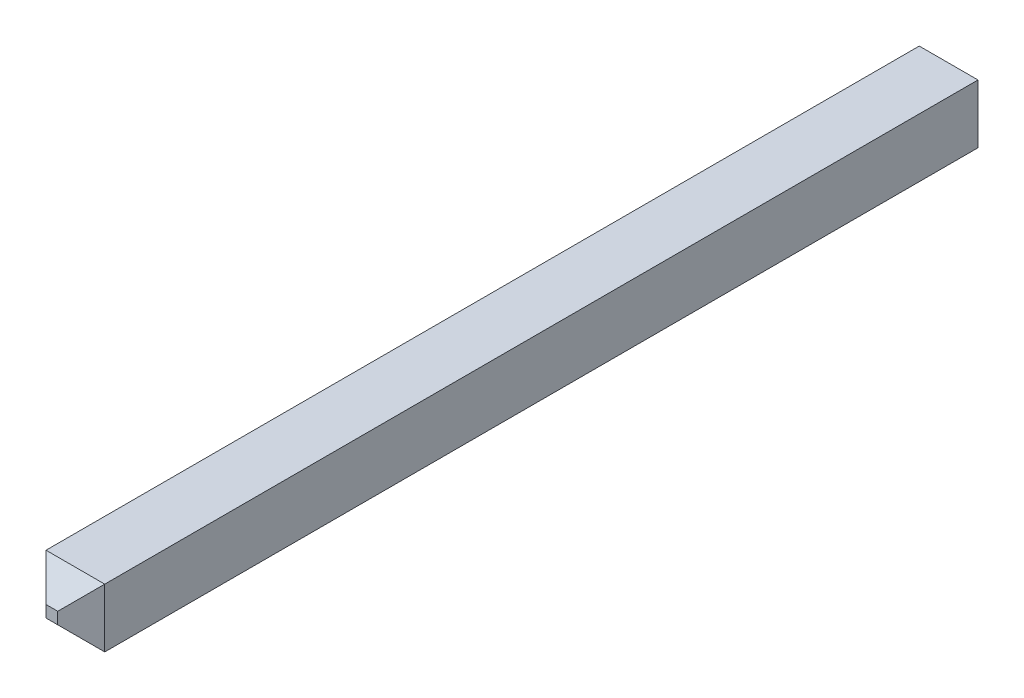
ISO-10303-21;
HEADER;
FILE_DESCRIPTION(('STEP AP214'),'2;1');
FILE_NAME('part.step','',(''),(''),'','','');
FILE_SCHEMA(('AUTOMOTIVE_DESIGN { 1 0 10303 214 1 1 1 1 }'));
ENDSEC;
DATA;
#1=APPLICATION_CONTEXT('core data for automotive mechanical design processes');
#2=APPLICATION_PROTOCOL_DEFINITION('international standard','automotive_design',2000,#1);
#3=PRODUCT_CONTEXT('',#1,'mechanical');
#4=PRODUCT('Part','Part','',(#3));
#5=PRODUCT_RELATED_PRODUCT_CATEGORY('part','',(#4));
#6=PRODUCT_DEFINITION_FORMATION('','',#4);
#7=PRODUCT_DEFINITION_CONTEXT('part definition',#1,'design');
#8=PRODUCT_DEFINITION('design','',#6,#7);
#9=PRODUCT_DEFINITION_SHAPE('','',#8);
#10=(LENGTH_UNIT() NAMED_UNIT(*) SI_UNIT(.MILLI.,.METRE.));
#11=(NAMED_UNIT(*) PLANE_ANGLE_UNIT() SI_UNIT($,.RADIAN.));
#12=(NAMED_UNIT(*) SI_UNIT($,.STERADIAN.) SOLID_ANGLE_UNIT());
#13=UNCERTAINTY_MEASURE_WITH_UNIT(LENGTH_MEASURE(1.E-05),#10,'distance_accuracy_value','');
#14=(GEOMETRIC_REPRESENTATION_CONTEXT(3) GLOBAL_UNCERTAINTY_ASSIGNED_CONTEXT((#13)) GLOBAL_UNIT_ASSIGNED_CONTEXT((#10,
#11,#12)) REPRESENTATION_CONTEXT('',''));
#15=CARTESIAN_POINT('',(0.,0.,0.));
#16=DIRECTION('',(0.,0.,1.));
#17=DIRECTION('',(1.,0.,0.));
#18=AXIS2_PLACEMENT_3D('',#15,#16,#17);
#19=CARTESIAN_POINT('',(1.03197587217093,-0.932973973763584,-0.0505976377952756));
#20=DIRECTION('',(0.,-0.707106781186551,-0.707106781186544));
#21=DIRECTION('',(0.,0.707106781186544,-0.707106781186551));
#22=AXIS2_PLACEMENT_3D('',#19,#20,#21);
#23=PLANE('',#22);
#24=DIRECTION('',(0.577350269189567,0.577350269189736,-0.577350269189575));
#25=VECTOR('',#24,1.);
#26=CARTESIAN_POINT('',(1.00097193516306,-0.932383422582481,-0.0511881889763817));
#27=LINE('',#26,#25);
#28=CARTESIAN_POINT('',(1.00097193516306,-0.932383422582481,-0.0511881889763791));
#29=VERTEX_POINT('',#28);
#30=CARTESIAN_POINT('',(1.0127829587851,-0.920572398960434,-0.0629992125984255));
#31=VERTEX_POINT('',#30);
#32=EDGE_CURVE('E79',#29,#31,#27,.T.);
#33=ORIENTED_EDGE('',*,*,#32,.T.);
#34=DIRECTION('',(1.,0.,0.));
#35=VECTOR('',#34,1.);
#36=CARTESIAN_POINT('',(1.01898374618668,-0.920572398960434,-0.0629992125984253));
#37=LINE('',#36,#35);
#38=CARTESIAN_POINT('',(1.01868847059613,-0.920572398960434,-0.0629992125984254));
#39=VERTEX_POINT('',#38);
#40=EDGE_CURVE('E20',#39,#31,#37,.F.);
#41=ORIENTED_EDGE('',*,*,#40,.F.);
#42=DIRECTION('',(0.577350269189648,-0.577350269189574,0.577350269189654));
#43=VECTOR('',#42,1.);
#44=CARTESIAN_POINT('',(1.01868847059613,-0.920572398960434,-0.0629992125984254));
#45=LINE('',#44,#43);
#46=CARTESIAN_POINT('',(1.03049949421818,-0.932383422582481,-0.051188188976378));
#47=VERTEX_POINT('',#46);
#48=EDGE_CURVE('E83',#39,#47,#45,.T.);
#49=ORIENTED_EDGE('',*,*,#48,.T.);
#50=DIRECTION('',(1.,0.,0.));
#51=VECTOR('',#50,1.);
#52=CARTESIAN_POINT('',(1.03197587217093,-0.932383422582481,-0.051188188976378));
#53=LINE('',#52,#51);
#54=EDGE_CURVE('E106',#47,#29,#53,.F.);
#55=ORIENTED_EDGE('',*,*,#54,.T.);
#56=EDGE_LOOP('',(#33,#41,#49,#55));
#57=FACE_BOUND('',#56,.T.);
#58=ADVANCED_FACE('F17',(#57),#23,.T.);
#59=CARTESIAN_POINT('',(0.999495557210301,-0.919981847779332,0.400189763779528));
#60=DIRECTION('',(0.,0.707106781186544,-0.707106781186551));
#61=DIRECTION('',(0.,0.707106781186551,0.707106781186544));
#62=AXIS2_PLACEMENT_3D('',#59,#60,#61);
#63=PLANE('',#62);
#64=DIRECTION('',(1.,0.,0.));
#65=VECTOR('',#64,1.);
#66=CARTESIAN_POINT('',(1.01898374618668,-0.920572398960434,0.399599212598425));
#67=LINE('',#66,#65);
#68=CARTESIAN_POINT('',(1.01868847059613,-0.920572398960434,0.399599212598426));
#69=VERTEX_POINT('',#68);
#70=CARTESIAN_POINT('',(1.0127829587851,-0.920572398960434,0.399599212598424));
#71=VERTEX_POINT('',#70);
#72=EDGE_CURVE('E117',#69,#71,#67,.F.);
#73=ORIENTED_EDGE('',*,*,#72,.T.);
#74=DIRECTION('',(0.577350269189571,0.577350269189741,0.577350269189566));
#75=VECTOR('',#74,1.);
#76=CARTESIAN_POINT('',(1.00097193516306,-0.932383422582481,0.387788188976378));
#77=LINE('',#76,#75);
#78=CARTESIAN_POINT('',(1.00097193516306,-0.932383422582481,0.387788188976378));
#79=VERTEX_POINT('',#78);
#80=EDGE_CURVE('E111',#79,#71,#77,.T.);
#81=ORIENTED_EDGE('',*,*,#80,.F.);
#82=DIRECTION('',(1.,0.,0.));
#83=VECTOR('',#82,1.);
#84=CARTESIAN_POINT('',(1.03197587217093,-0.932383422582481,0.387788188976378));
#85=LINE('',#84,#83);
#86=CARTESIAN_POINT('',(1.03049949421818,-0.932383422582481,0.387788188976378));
#87=VERTEX_POINT('',#86);
#88=EDGE_CURVE('E104',#79,#87,#85,.T.);
#89=ORIENTED_EDGE('',*,*,#88,.T.);
#90=DIRECTION('',(0.577350269189653,-0.577350269189579,-0.577350269189645));
#91=VECTOR('',#90,1.);
#92=CARTESIAN_POINT('',(1.01868847059613,-0.920572398960434,0.399599212598426));
#93=LINE('',#92,#91);
#94=EDGE_CURVE('E108',#69,#87,#93,.T.);
#95=ORIENTED_EDGE('',*,*,#94,.F.);
#96=EDGE_LOOP('',(#73,#81,#89,#95));
#97=FACE_BOUND('',#96,.T.);
#98=ADVANCED_FACE('F175',(#97),#63,.F.);
#99=CARTESIAN_POINT('',(1.01898374618668,-0.920867674550985,-0.0629992125984253));
#100=DIRECTION('',(0.,0.,-1.));
#101=DIRECTION('',(0.,1.,0.));
#102=AXIS2_PLACEMENT_3D('',#99,#100,#101);
#103=PLANE('',#102);
#104=DIRECTION('',(0.,1.,0.));
#105=VECTOR('',#104,1.);
#106=CARTESIAN_POINT('',(1.0127829587851,-0.901379485574607,-0.0629992125984255));
#107=LINE('',#106,#105);
#108=CARTESIAN_POINT('',(1.0127829587851,-0.914666887149411,-0.0629992125984255));
#109=VERTEX_POINT('',#108);
#110=EDGE_CURVE('E100',#31,#109,#107,.T.);
#111=ORIENTED_EDGE('',*,*,#110,.T.);
#112=DIRECTION('',(1.,0.,0.));
#113=VECTOR('',#112,1.);
#114=CARTESIAN_POINT('',(1.03197587217093,-0.914666887149411,-0.0629992125984256));
#115=LINE('',#114,#113);
#116=CARTESIAN_POINT('',(1.01868847059613,-0.914666887149411,-0.0629992125984254));
#117=VERTEX_POINT('',#116);
#118=EDGE_CURVE('E91',#109,#117,#115,.T.);
#119=ORIENTED_EDGE('',*,*,#118,.T.);
#120=DIRECTION('',(0.,1.,0.));
#121=VECTOR('',#120,1.);
#122=CARTESIAN_POINT('',(1.01868847059613,-0.933859800535237,-0.0629992125984254));
#123=LINE('',#122,#121);
#124=EDGE_CURVE('E87',#117,#39,#123,.F.);
#125=ORIENTED_EDGE('',*,*,#124,.T.);
#126=ORIENTED_EDGE('',*,*,#40,.T.);
#127=EDGE_LOOP('',(#111,#119,#125,#126));
#128=FACE_BOUND('',#127,.T.);
#129=ADVANCED_FACE('F89',(#128),#103,.T.);
#130=CARTESIAN_POINT('',(1.03109004539928,-0.933859800535237,-0.0505976377952756));
#131=DIRECTION('',(-0.707106781186552,0.,0.707106781186543));
#132=DIRECTION('',(0.707106781186543,0.,0.707106781186552));
#133=AXIS2_PLACEMENT_3D('',#130,#131,#132);
#134=PLANE('',#133);
#135=ORIENTED_EDGE('',*,*,#48,.F.);
#136=ORIENTED_EDGE('',*,*,#124,.F.);
#137=DIRECTION('',(0.577350269189698,0.577350269189586,0.577350269189593));
#138=VECTOR('',#137,1.);
#139=CARTESIAN_POINT('',(1.01868847059613,-0.914666887149411,-0.0629992125984256));
#140=LINE('',#139,#138);
#141=CARTESIAN_POINT('',(1.03049949421818,-0.902855863527363,-0.0511881889763773));
#142=VERTEX_POINT('',#141);
#143=EDGE_CURVE('E131',#117,#142,#140,.T.);
#144=ORIENTED_EDGE('',*,*,#143,.T.);
#145=DIRECTION('',(0.,1.,0.));
#146=VECTOR('',#145,1.);
#147=CARTESIAN_POINT('',(1.03049949421818,-0.933859800535237,-0.051188188976378));
#148=LINE('',#147,#146);
#149=EDGE_CURVE('E97',#47,#142,#148,.T.);
#150=ORIENTED_EDGE('',*,*,#149,.F.);
#151=EDGE_LOOP('',(#135,#136,#144,#150));
#152=FACE_BOUND('',#151,.T.);
#153=ADVANCED_FACE('F95',(#152),#134,.F.);
#154=CARTESIAN_POINT('',(1.00038138398195,-0.901379485574607,-0.0505976377952756));
#155=DIRECTION('',(0.707106781186552,0.,0.707106781186543));
#156=DIRECTION('',(0.707106781186543,0.,-0.707106781186552));
#157=AXIS2_PLACEMENT_3D('',#154,#155,#156);
#158=PLANE('',#157);
#159=ORIENTED_EDGE('',*,*,#32,.F.);
#160=DIRECTION('',(0.,-1.,0.));
#161=VECTOR('',#160,1.);
#162=CARTESIAN_POINT('',(1.00097193516306,-0.901379485574607,-0.051188188976378));
#163=LINE('',#162,#161);
#164=CARTESIAN_POINT('',(1.00097193516306,-0.902855863527363,-0.0511881889763798));
#165=VERTEX_POINT('',#164);
#166=EDGE_CURVE('E133',#165,#29,#163,.T.);
#167=ORIENTED_EDGE('',*,*,#166,.F.);
#168=DIRECTION('',(0.57735026918938,-0.577350269189746,-0.577350269189752));
#169=VECTOR('',#168,1.);
#170=CARTESIAN_POINT('',(1.00097193516306,-0.902855863527363,-0.0511881889763778));
#171=LINE('',#170,#169);
#172=EDGE_CURVE('E127',#165,#109,#171,.T.);
#173=ORIENTED_EDGE('',*,*,#172,.T.);
#174=ORIENTED_EDGE('',*,*,#110,.F.);
#175=EDGE_LOOP('',(#159,#167,#173,#174));
#176=FACE_BOUND('',#175,.T.);
#177=ADVANCED_FACE('F209',(#176),#158,.F.);
#178=CARTESIAN_POINT('',(1.03197587217093,-0.932383422582481,0.152158267716535));
#179=DIRECTION('',(0.,1.,0.));
#180=DIRECTION('',(0.,0.,1.));
#181=AXIS2_PLACEMENT_3D('',#178,#179,#180);
#182=PLANE('',#181);
#183=ORIENTED_EDGE('',*,*,#54,.F.);
#184=DIRECTION('',(0.,0.,1.));
#185=VECTOR('',#184,1.);
#186=CARTESIAN_POINT('',(1.03049949421818,-0.932383422582481,0.152158267716535));
#187=LINE('',#186,#185);
#188=EDGE_CURVE('E121',#87,#47,#187,.F.);
#189=ORIENTED_EDGE('',*,*,#188,.F.);
#190=ORIENTED_EDGE('',*,*,#88,.F.);
#191=DIRECTION('',(0.,0.,1.));
#192=VECTOR('',#191,1.);
#193=CARTESIAN_POINT('',(1.00097193516306,-0.932383422582481,0.152158267716535));
#194=LINE('',#193,#192);
#195=EDGE_CURVE('E136',#29,#79,#194,.T.);
#196=ORIENTED_EDGE('',*,*,#195,.F.);
#197=EDGE_LOOP('',(#183,#189,#190,#196));
#198=FACE_BOUND('',#197,.T.);
#199=ADVANCED_FACE('F187',(#198),#182,.F.);
#200=CARTESIAN_POINT('',(1.01809791941503,-0.901379485574607,0.400189763779528));
#201=DIRECTION('',(0.707106781186544,0.,0.707106781186551));
#202=DIRECTION('',(0.707106781186551,0.,-0.707106781186544));
#203=AXIS2_PLACEMENT_3D('',#200,#201,#202);
#204=PLANE('',#203);
#205=DIRECTION('',(0.,1.,0.));
#206=VECTOR('',#205,1.);
#207=CARTESIAN_POINT('',(1.03049949421818,-0.933859800535237,0.387788188976378));
#208=LINE('',#207,#206);
#209=CARTESIAN_POINT('',(1.03049949421818,-0.902855863527363,0.387788188976378));
#210=VERTEX_POINT('',#209);
#211=EDGE_CURVE('E124',#210,#87,#208,.F.);
#212=ORIENTED_EDGE('',*,*,#211,.F.);
#213=DIRECTION('',(0.577350269189702,0.57735026918959,-0.577350269189585));
#214=VECTOR('',#213,1.);
#215=CARTESIAN_POINT('',(1.01868847059613,-0.914666887149411,0.399599212598426));
#216=LINE('',#215,#214);
#217=CARTESIAN_POINT('',(1.01868847059613,-0.914666887149411,0.399599212598426));
#218=VERTEX_POINT('',#217);
#219=EDGE_CURVE('E141',#218,#210,#216,.T.);
#220=ORIENTED_EDGE('',*,*,#219,.F.);
#221=DIRECTION('',(0.,1.,0.));
#222=VECTOR('',#221,1.);
#223=CARTESIAN_POINT('',(1.01868847059613,-0.920867674550985,0.399599212598425));
#224=LINE('',#223,#222);
#225=EDGE_CURVE('E114',#218,#69,#224,.F.);
#226=ORIENTED_EDGE('',*,*,#225,.T.);
#227=ORIENTED_EDGE('',*,*,#94,.T.);
#228=EDGE_LOOP('',(#212,#220,#226,#227));
#229=FACE_BOUND('',#228,.T.);
#230=ADVANCED_FACE('F168',(#229),#204,.T.);
#231=CARTESIAN_POINT('',(1.01337350996621,-0.933859800535237,0.400189763779528));
#232=DIRECTION('',(-0.707106781186544,0.,0.707106781186551));
#233=DIRECTION('',(0.707106781186551,0.,0.707106781186544));
#234=AXIS2_PLACEMENT_3D('',#231,#232,#233);
#235=PLANE('',#234);
#236=DIRECTION('',(0.,1.,0.));
#237=VECTOR('',#236,1.);
#238=CARTESIAN_POINT('',(1.0127829587851,-0.920867674550985,0.399599212598425));
#239=LINE('',#238,#237);
#240=CARTESIAN_POINT('',(1.0127829587851,-0.914666887149411,0.399599212598423));
#241=VERTEX_POINT('',#240);
#242=EDGE_CURVE('E119',#71,#241,#239,.T.);
#243=ORIENTED_EDGE('',*,*,#242,.T.);
#244=DIRECTION('',(0.577350269189384,-0.577350269189749,0.577350269189744));
#245=VECTOR('',#244,1.);
#246=CARTESIAN_POINT('',(1.00097193516306,-0.902855863527363,0.387788188976378));
#247=LINE('',#246,#245);
#248=CARTESIAN_POINT('',(1.00097193516306,-0.902855863527363,0.387788188976378));
#249=VERTEX_POINT('',#248);
#250=EDGE_CURVE('E35',#249,#241,#247,.T.);
#251=ORIENTED_EDGE('',*,*,#250,.F.);
#252=DIRECTION('',(0.,-1.,0.));
#253=VECTOR('',#252,1.);
#254=CARTESIAN_POINT('',(1.00097193516306,-0.901379485574607,0.387788188976378));
#255=LINE('',#254,#253);
#256=EDGE_CURVE('E139',#79,#249,#255,.F.);
#257=ORIENTED_EDGE('',*,*,#256,.F.);
#258=ORIENTED_EDGE('',*,*,#80,.T.);
#259=EDGE_LOOP('',(#243,#251,#257,#258));
#260=FACE_BOUND('',#259,.T.);
#261=ADVANCED_FACE('F177',(#260),#235,.T.);
#262=CARTESIAN_POINT('',(1.01898374618668,-0.920867674550985,0.399599212598425));
#263=DIRECTION('',(0.,0.,-1.));
#264=DIRECTION('',(0.,1.,0.));
#265=AXIS2_PLACEMENT_3D('',#262,#263,#264);
#266=PLANE('',#265);
#267=ORIENTED_EDGE('',*,*,#72,.F.);
#268=ORIENTED_EDGE('',*,*,#225,.F.);
#269=DIRECTION('',(1.,0.,0.));
#270=VECTOR('',#269,1.);
#271=CARTESIAN_POINT('',(0.999495557210301,-0.914666887149411,0.399599212598426));
#272=LINE('',#271,#270);
#273=EDGE_CURVE('E145',#241,#218,#272,.T.);
#274=ORIENTED_EDGE('',*,*,#273,.F.);
#275=ORIENTED_EDGE('',*,*,#242,.F.);
#276=EDGE_LOOP('',(#267,#268,#274,#275));
#277=FACE_BOUND('',#276,.T.);
#278=ADVANCED_FACE('F172',(#277),#266,.F.);
#279=CARTESIAN_POINT('',(1.03049949421818,-0.933859800535237,0.152158267716535));
#280=DIRECTION('',(1.,0.,0.));
#281=DIRECTION('',(0.,1.,0.));
#282=AXIS2_PLACEMENT_3D('',#279,#280,#281);
#283=PLANE('',#282);
#284=DIRECTION('',(0.,0.,1.));
#285=VECTOR('',#284,1.);
#286=CARTESIAN_POINT('',(1.03049949421818,-0.902855863527363,0.152158267716535));
#287=LINE('',#286,#285);
#288=EDGE_CURVE('E148',#210,#142,#287,.F.);
#289=ORIENTED_EDGE('',*,*,#288,.F.);
#290=ORIENTED_EDGE('',*,*,#211,.T.);
#291=ORIENTED_EDGE('',*,*,#188,.T.);
#292=ORIENTED_EDGE('',*,*,#149,.T.);
#293=EDGE_LOOP('',(#289,#290,#291,#292));
#294=FACE_BOUND('',#293,.T.);
#295=ADVANCED_FACE('F185',(#294),#283,.T.);
#296=CARTESIAN_POINT('',(1.03197587217093,-0.902265312346261,-0.0505976377952756));
#297=DIRECTION('',(0.,-0.707106781186552,0.707106781186543));
#298=DIRECTION('',(0.,-0.707106781186543,-0.707106781186552));
#299=AXIS2_PLACEMENT_3D('',#296,#297,#298);
#300=PLANE('',#299);
#301=ORIENTED_EDGE('',*,*,#118,.F.);
#302=ORIENTED_EDGE('',*,*,#172,.F.);
#303=DIRECTION('',(1.,0.,0.));
#304=VECTOR('',#303,1.);
#305=CARTESIAN_POINT('',(1.03197587217093,-0.902855863527363,-0.051188188976378));
#306=LINE('',#305,#304);
#307=EDGE_CURVE('E151',#142,#165,#306,.F.);
#308=ORIENTED_EDGE('',*,*,#307,.F.);
#309=ORIENTED_EDGE('',*,*,#143,.F.);
#310=EDGE_LOOP('',(#301,#302,#308,#309));
#311=FACE_BOUND('',#310,.T.);
#312=ADVANCED_FACE('F198',(#311),#300,.F.);
#313=CARTESIAN_POINT('',(1.00097193516306,-0.901379485574607,0.152158267716535));
#314=DIRECTION('',(-1.,0.,0.));
#315=DIRECTION('',(0.,-1.,0.));
#316=AXIS2_PLACEMENT_3D('',#313,#314,#315);
#317=PLANE('',#316);
#318=ORIENTED_EDGE('',*,*,#195,.T.);
#319=ORIENTED_EDGE('',*,*,#256,.T.);
#320=DIRECTION('',(0.,0.,1.));
#321=VECTOR('',#320,1.);
#322=CARTESIAN_POINT('',(1.00097193516306,-0.902855863527363,0.152158267716535));
#323=LINE('',#322,#321);
#324=EDGE_CURVE('E26',#165,#249,#323,.T.);
#325=ORIENTED_EDGE('',*,*,#324,.F.);
#326=ORIENTED_EDGE('',*,*,#166,.T.);
#327=EDGE_LOOP('',(#318,#319,#325,#326));
#328=FACE_BOUND('',#327,.T.);
#329=ADVANCED_FACE('F161',(#328),#317,.T.);
#330=CARTESIAN_POINT('',(0.999495557210301,-0.915257438330513,0.400189763779528));
#331=DIRECTION('',(0.,0.707106781186543,0.707106781186552));
#332=DIRECTION('',(0.,-0.707106781186552,0.707106781186543));
#333=AXIS2_PLACEMENT_3D('',#330,#331,#332);
#334=PLANE('',#333);
#335=ORIENTED_EDGE('',*,*,#250,.T.);
#336=ORIENTED_EDGE('',*,*,#273,.T.);
#337=ORIENTED_EDGE('',*,*,#219,.T.);
#338=DIRECTION('',(1.,0.,0.));
#339=VECTOR('',#338,1.);
#340=CARTESIAN_POINT('',(1.03197587217093,-0.902855863527363,0.387788188976378));
#341=LINE('',#340,#339);
#342=EDGE_CURVE('E11',#249,#210,#341,.T.);
#343=ORIENTED_EDGE('',*,*,#342,.F.);
#344=EDGE_LOOP('',(#335,#336,#337,#343));
#345=FACE_BOUND('',#344,.T.);
#346=ADVANCED_FACE('F164',(#345),#334,.T.);
#347=CARTESIAN_POINT('',(1.03197587217093,-0.902855863527363,0.152158267716535));
#348=DIRECTION('',(0.,1.,0.));
#349=DIRECTION('',(0.,0.,1.));
#350=AXIS2_PLACEMENT_3D('',#347,#348,#349);
#351=PLANE('',#350);
#352=ORIENTED_EDGE('',*,*,#324,.T.);
#353=ORIENTED_EDGE('',*,*,#342,.T.);
#354=ORIENTED_EDGE('',*,*,#288,.T.);
#355=ORIENTED_EDGE('',*,*,#307,.T.);
#356=EDGE_LOOP('',(#352,#353,#354,#355));
#357=FACE_BOUND('',#356,.T.);
#358=ADVANCED_FACE('F157',(#357),#351,.T.);
#359=CLOSED_SHELL('',(#58,#98,#129,#153,#177,#199,#230,#261,#278,#295,#312,#329,#346,#358));
#360=MANIFOLD_SOLID_BREP('B1',#359);
#361=ADVANCED_BREP_SHAPE_REPRESENTATION('',(#18,#360),#14);
#362=SHAPE_DEFINITION_REPRESENTATION(#9,#361);
ENDSEC;
END-ISO-10303-21;
